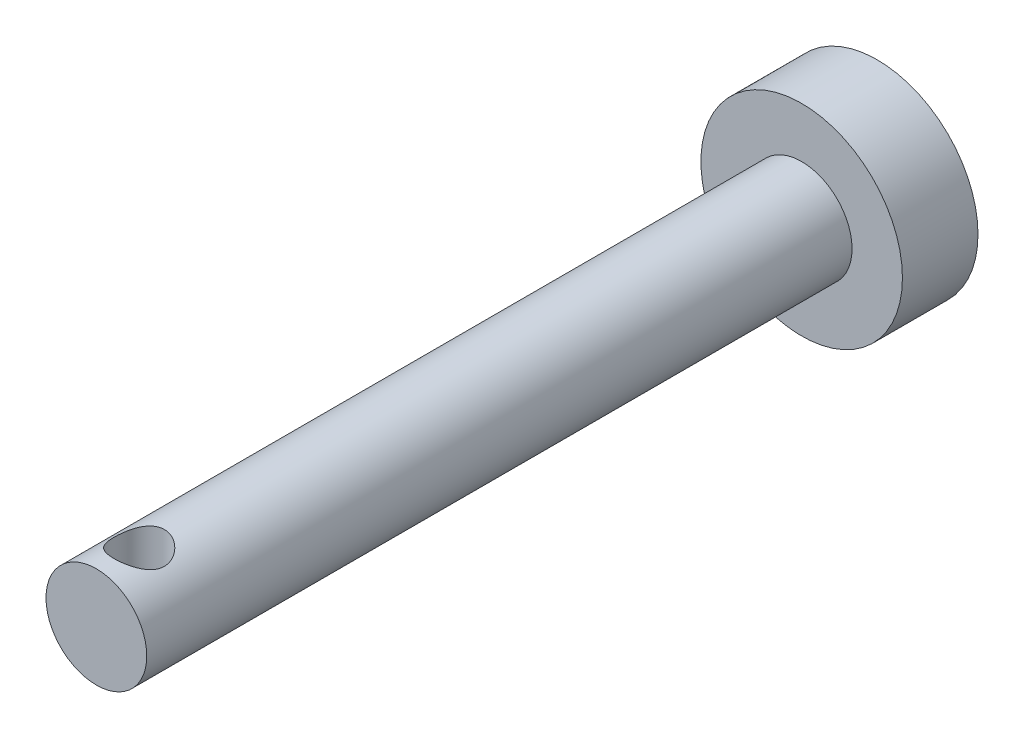
ISO-10303-21;
HEADER;
FILE_DESCRIPTION(('STEP AP214'),'2;1');
FILE_NAME('part.step','',(''),(''),'','','');
FILE_SCHEMA(('AUTOMOTIVE_DESIGN { 1 0 10303 214 1 1 1 1 }'));
ENDSEC;
DATA;
#1=APPLICATION_CONTEXT('core data for automotive mechanical design processes');
#2=APPLICATION_PROTOCOL_DEFINITION('international standard','automotive_design',2000,#1);
#3=PRODUCT_CONTEXT('',#1,'mechanical');
#4=PRODUCT('Part','Part','',(#3));
#5=PRODUCT_RELATED_PRODUCT_CATEGORY('part','',(#4));
#6=PRODUCT_DEFINITION_FORMATION('','',#4);
#7=PRODUCT_DEFINITION_CONTEXT('part definition',#1,'design');
#8=PRODUCT_DEFINITION('design','',#6,#7);
#9=PRODUCT_DEFINITION_SHAPE('','',#8);
#10=(LENGTH_UNIT() NAMED_UNIT(*) SI_UNIT(.MILLI.,.METRE.));
#11=(NAMED_UNIT(*) PLANE_ANGLE_UNIT() SI_UNIT($,.RADIAN.));
#12=(NAMED_UNIT(*) SI_UNIT($,.STERADIAN.) SOLID_ANGLE_UNIT());
#13=UNCERTAINTY_MEASURE_WITH_UNIT(LENGTH_MEASURE(1.E-05),#10,'distance_accuracy_value','');
#14=(GEOMETRIC_REPRESENTATION_CONTEXT(3) GLOBAL_UNCERTAINTY_ASSIGNED_CONTEXT((#13)) GLOBAL_UNIT_ASSIGNED_CONTEXT((#10,
#11,#12)) REPRESENTATION_CONTEXT('',''));
#15=CARTESIAN_POINT('',(0.,0.,0.));
#16=DIRECTION('',(0.,0.,1.));
#17=DIRECTION('',(1.,0.,0.));
#18=AXIS2_PLACEMENT_3D('',#15,#16,#17);
#19=CARTESIAN_POINT('',(0.,0.,-125.));
#20=DIRECTION('',(0.,0.,1.));
#21=DIRECTION('',(1.,0.,0.));
#22=AXIS2_PLACEMENT_3D('',#19,#20,#21);
#23=PLANE('',#22);
#24=CARTESIAN_POINT('',(0.,0.,-125.));
#25=DIRECTION('',(0.,0.,1.));
#26=DIRECTION('',(1.,0.,0.));
#27=AXIS2_PLACEMENT_3D('',#24,#25,#26);
#28=CIRCLE('',#27,4.);
#29=CARTESIAN_POINT('',(4.,0.,-125.));
#30=VERTEX_POINT('',#29);
#31=EDGE_CURVE('E10',#30,#30,#28,.T.);
#32=ORIENTED_EDGE('',*,*,#31,.F.);
#33=EDGE_LOOP('',(#32));
#34=FACE_BOUND('',#33,.T.);
#35=ADVANCED_FACE('F32',(#34),#23,.F.);
#36=CARTESIAN_POINT('',(0.,0.,125.));
#37=DIRECTION('',(0.,0.,1.));
#38=DIRECTION('',(1.,0.,0.));
#39=AXIS2_PLACEMENT_3D('',#36,#37,#38);
#40=CYLINDRICAL_SURFACE('',#39,4.);
#41=CARTESIAN_POINT('',(0.,0.,-122.));
#42=DIRECTION('',(0.,0.,1.));
#43=DIRECTION('',(1.,0.,0.));
#44=AXIS2_PLACEMENT_3D('',#41,#42,#43);
#45=CIRCLE('',#44,4.);
#46=CARTESIAN_POINT('',(4.,0.,-122.));
#47=VERTEX_POINT('',#46);
#48=EDGE_CURVE('E44',#47,#47,#45,.T.);
#49=ORIENTED_EDGE('',*,*,#48,.F.);
#50=EDGE_LOOP('',(#49));
#51=FACE_BOUND('',#50,.T.);
#52=ORIENTED_EDGE('',*,*,#31,.T.);
#53=EDGE_LOOP('',(#52));
#54=FACE_BOUND('',#53,.T.);
#55=ADVANCED_FACE('F79',(#51,#54),#40,.T.);
#56=CARTESIAN_POINT('',(0.,4.,-122.));
#57=DIRECTION('',(0.,0.,-1.));
#58=DIRECTION('',(-1.,0.,0.));
#59=AXIS2_PLACEMENT_3D('',#56,#57,#58);
#60=PLANE('',#59);
#61=CARTESIAN_POINT('',(0.,0.,-122.));
#62=DIRECTION('',(0.,0.,1.));
#63=DIRECTION('',(1.,0.,0.));
#64=AXIS2_PLACEMENT_3D('',#61,#62,#63);
#65=CIRCLE('',#64,2.00000000000003);
#66=CARTESIAN_POINT('',(2.00000000000003,0.,-122.));
#67=VERTEX_POINT('',#66);
#68=EDGE_CURVE('E49',#67,#67,#65,.T.);
#69=ORIENTED_EDGE('',*,*,#68,.F.);
#70=EDGE_LOOP('',(#69));
#71=FACE_BOUND('',#70,.T.);
#72=ORIENTED_EDGE('',*,*,#48,.T.);
#73=EDGE_LOOP('',(#72));
#74=FACE_BOUND('',#73,.T.);
#75=ADVANCED_FACE('F75',(#71,#74),#60,.F.);
#76=CARTESIAN_POINT('',(0.,0.,125.));
#77=DIRECTION('',(0.,0.,1.));
#78=DIRECTION('',(1.,0.,0.));
#79=AXIS2_PLACEMENT_3D('',#76,#77,#78);
#80=CYLINDRICAL_SURFACE('',#79,2.00000000000002);
#81=CARTESIAN_POINT('',(0.,-2.00000000000002,-94.7));
#82=CARTESIAN_POINT('',(0.0525719629529861,-1.99999713404152,-94.7000033023195));
#83=CARTESIAN_POINT('',(0.105206599698032,-1.99790491019519,-94.7041700731217));
#84=CARTESIAN_POINT('',(0.208920235268424,-1.98974156037398,-94.7206528803409));
#85=CARTESIAN_POINT('',(0.259996086713503,-1.98366287828985,-94.7329843929976));
#86=CARTESIAN_POINT('',(0.358933544880574,-1.96816279403313,-94.7651938086168));
#87=CARTESIAN_POINT('',(0.406806802939178,-1.95875439177522,-94.785042384248));
#88=CARTESIAN_POINT('',(0.498472616806563,-1.9374577651578,-94.8315706213649));
#89=CARTESIAN_POINT('',(0.542265493990048,-1.92556973633532,-94.8582497442489));
#90=CARTESIAN_POINT('',(0.62750781776192,-1.89956258258059,-94.9195172494853));
#91=CARTESIAN_POINT('',(0.668655211122115,-1.88535199127537,-94.9544864792396));
#92=CARTESIAN_POINT('',(0.744779444866981,-1.85659970246746,-95.030521479247));
#93=CARTESIAN_POINT('',(0.779751583106767,-1.84205776209037,-95.0715918517724));
#94=CARTESIAN_POINT('',(0.845252000450278,-1.81298951197349,-95.1624833495234));
#95=CARTESIAN_POINT('',(0.875225335551638,-1.79855186970133,-95.2127360983459));
#96=CARTESIAN_POINT('',(0.926168226890698,-1.77285978772322,-95.3183673359862));
#97=CARTESIAN_POINT('',(0.947144214966336,-1.76160307606991,-95.3737421287227));
#98=CARTESIAN_POINT('',(0.978132442188591,-1.7445786703781,-95.4846651054219));
#99=CARTESIAN_POINT('',(0.988725857080443,-1.73852271583715,-95.5400044520674));
#100=CARTESIAN_POINT('',(1.00042699330885,-1.73181889948529,-95.6519788377795));
#101=CARTESIAN_POINT('',(1.00154408837308,-1.7311656934329,-95.7086125408712));
#102=CARTESIAN_POINT('',(0.994687287172293,-1.7351093025725,-95.8142860243154));
#103=CARTESIAN_POINT('',(0.987784559536819,-1.73908763662015,-95.863424031223));
#104=CARTESIAN_POINT('',(0.966939849056931,-1.75076228733852,-95.959721909373));
#105=CARTESIAN_POINT('',(0.952995623897653,-1.75845978831778,-96.0068811453053));
#106=CARTESIAN_POINT('',(0.918209780386007,-1.77687476412743,-96.0992291325657));
#107=CARTESIAN_POINT('',(0.897215067115996,-1.78765840664,-96.1443463987858));
#108=CARTESIAN_POINT('',(0.849041687668001,-1.81103404281405,-96.23063429259));
#109=CARTESIAN_POINT('',(0.821860243812466,-1.82362684780192,-96.2718031356001));
#110=CARTESIAN_POINT('',(0.758066054912789,-1.85113157903287,-96.3545212527432));
#111=CARTESIAN_POINT('',(0.720694458369284,-1.86613510236748,-96.3954568735762));
#112=CARTESIAN_POINT('',(0.639555578741373,-1.89547623300409,-96.4707354185909));
#113=CARTESIAN_POINT('',(0.595785256574281,-1.90981351958803,-96.5050751920339));
#114=CARTESIAN_POINT('',(0.500516505831843,-1.93701987282966,-96.5676856610297));
#115=CARTESIAN_POINT('',(0.448753591599406,-1.94978984162009,-96.5956004724457));
#116=CARTESIAN_POINT('',(0.340466215488797,-1.97157881121244,-96.642097029043));
#117=CARTESIAN_POINT('',(0.283945576265277,-1.98060078943554,-96.6606861850152));
#118=CARTESIAN_POINT('',(0.172766491660702,-1.99324333741438,-96.6864754037167));
#119=CARTESIAN_POINT('',(0.118341530548324,-1.99724938301313,-96.6944912357468));
#120=CARTESIAN_POINT('',(0.00877959994935263,-2.00073013459103,-96.7014647311345));
#121=CARTESIAN_POINT('',(-0.0463570198699035,-2.00020698721314,-96.7004266856395));
#122=CARTESIAN_POINT('',(-0.151232971985996,-1.99491192253442,-96.6897933115812));
#123=CARTESIAN_POINT('',(-0.201059408049955,-1.99047245688191,-96.68086746727));
#124=CARTESIAN_POINT('',(-0.298406892301917,-1.9782217131482,-96.6557619281049));
#125=CARTESIAN_POINT('',(-0.345927685690998,-1.97041006334334,-96.6395814335466));
#126=CARTESIAN_POINT('',(-0.438888608449671,-1.95184251413671,-96.6000015335668));
#127=CARTESIAN_POINT('',(-0.484230397006162,-1.94100881769941,-96.5764089498832));
#128=CARTESIAN_POINT('',(-0.570461361698928,-1.9174397431711,-96.5228924643539));
#129=CARTESIAN_POINT('',(-0.611348629775286,-1.90470355565787,-96.4929658654066));
#130=CARTESIAN_POINT('',(-0.691767689290655,-1.87708221337466,-96.4242395746671));
#131=CARTESIAN_POINT('',(-0.730772077824641,-1.86210884848443,-96.3848571315464));
#132=CARTESIAN_POINT('',(-0.801856321113242,-1.83262391603876,-96.3000748487307));
#133=CARTESIAN_POINT('',(-0.833931385690844,-1.81811267381528,-96.2546708811836));
#134=CARTESIAN_POINT('',(-0.891707914497697,-1.7905119222607,-96.1563563457997));
#135=CARTESIAN_POINT('',(-0.917025495878638,-1.77752529663474,-96.1031887337914));
#136=CARTESIAN_POINT('',(-0.958082826013803,-1.75574072368128,-95.9924899323075));
#137=CARTESIAN_POINT('',(-0.97383491588757,-1.7469373824062,-95.9349644734988));
#138=CARTESIAN_POINT('',(-0.993861687449679,-1.73561501008669,-95.8230897771385));
#139=CARTESIAN_POINT('',(-0.999092996400865,-1.73257383460493,-95.768965746571));
#140=CARTESIAN_POINT('',(-1.00068915438079,-1.73165354646177,-95.6605529328293));
#141=CARTESIAN_POINT('',(-0.9970578466244,-1.73377219627554,-95.6062642312606));
#142=CARTESIAN_POINT('',(-0.981926125592264,-1.74237862050026,-95.504516498468));
#143=CARTESIAN_POINT('',(-0.9712083143428,-1.74843094482395,-95.4568995298556));
#144=CARTESIAN_POINT('',(-0.943175358224643,-1.76371016187919,-95.3641918805753));
#145=CARTESIAN_POINT('',(-0.925858091159808,-1.77293807569677,-95.319102017908));
#146=CARTESIAN_POINT('',(-0.88381574530068,-1.7942853036453,-95.2293751490134));
#147=CARTESIAN_POINT('',(-0.858671137816454,-1.80655722396193,-95.1849720981703));
#148=CARTESIAN_POINT('',(-0.802150971636628,-1.83235331634592,-95.1007254638194));
#149=CARTESIAN_POINT('',(-0.77077217123864,-1.84587813794524,-95.0608842694815));
#150=CARTESIAN_POINT('',(-0.698203326664633,-1.87462323159315,-94.9818580176424));
#151=CARTESIAN_POINT('',(-0.656284423010165,-1.8898498331147,-94.9433408976381));
#152=CARTESIAN_POINT('',(-0.566154806220276,-1.91877752255089,-94.8737370165764));
#153=CARTESIAN_POINT('',(-0.517940723256782,-1.93247778608042,-94.8426542605737));
#154=CARTESIAN_POINT('',(-0.415931596819944,-1.95698009585105,-94.7887636372378));
#155=CARTESIAN_POINT('',(-0.362099503934612,-1.96776096562911,-94.7660158305886));
#156=CARTESIAN_POINT('',(-0.250742101294191,-1.98501341363467,-94.730191832081));
#157=CARTESIAN_POINT('',(-0.193227799623167,-1.99149723372934,-94.7170881531704));
#158=CARTESIAN_POINT('',(-0.112601946483385,-1.99695461909665,-94.7061025889241));
#159=CARTESIAN_POINT('',(-0.0901618794395,-1.99809365339203,-94.7038173591364));
#160=CARTESIAN_POINT('',(-0.0451517318071583,-1.99961696977866,-94.7007653344832));
#161=CARTESIAN_POINT('',(-0.0225816476473817,-2.00000123103765,-94.6999985815288));
#162=CARTESIAN_POINT('',(0.,-2.00000000000002,-94.7));
#163=B_SPLINE_CURVE_WITH_KNOTS('',3,(#81,#82,#83,#84,#85,#86,#87,#88,#89,#90,#91,#92,#93,#94,
#95,#96,#97,#98,#99,#100,#101,#102,#103,#104,#105,#106,#107,#108,#109,#110,#111,#112,#113,#114,
#115,#116,#117,#118,#119,#120,#121,#122,#123,#124,#125,#126,#127,#128,#129,#130,#131,#132,#133,
#134,#135,#136,#137,#138,#139,#140,#141,#142,#143,#144,#145,#146,#147,#148,#149,#150,#151,#152,
#153,#154,#155,#156,#157,#158,#159,#160,#161,#162),.UNSPECIFIED.,.T.,.F.,(4,2,2,2,2,2,2,2,2,2,2,
2,2,2,2,2,2,2,2,2,2,2,2,2,2,2,2,2,2,2,2,2,2,2,2,2,2,2,2,2,4),(0.,0.157624257420292,
0.315548149709195,0.472862155492292,0.630163760581568,0.796981758718097,0.96392623765404,
1.14381726430753,1.32357947898281,1.4925801214023,1.66141357329022,1.81005712409322,
1.95874803925679,2.11090240168488,2.26312521260222,2.43464941333879,2.60625534598687,
2.78583022214441,2.9652621691228,3.12983290471346,3.29432564511476,3.44606906506122,
3.59782921630932,3.753928560279,3.91009450748339,4.08159610644419,4.25321588615433,
4.43314682159675,4.61284511940778,4.77529307498373,4.93767059860005,5.08457930244184,
5.23153528783679,5.38836456775616,5.54527561138959,5.721252427525,5.89732383376574,
6.07464013662926,6.2514490862493,6.31915280137698,6.38685838514847),.UNSPECIFIED.);
#164=CARTESIAN_POINT('',(0.,-2.00000000000002,-94.7));
#165=VERTEX_POINT('',#164);
#166=EDGE_CURVE('E35',#165,#165,#163,.T.);
#167=ORIENTED_EDGE('',*,*,#166,.T.);
#168=EDGE_LOOP('',(#167));
#169=FACE_BOUND('',#168,.T.);
#170=CARTESIAN_POINT('',(0.,2.00000000000002,-94.7));
#171=CARTESIAN_POINT('',(-0.0525719629529861,1.99999713404152,-94.7000033023195));
#172=CARTESIAN_POINT('',(-0.105206599698032,1.99790491019519,-94.7041700731217));
#173=CARTESIAN_POINT('',(-0.208920235268424,1.98974156037398,-94.7206528803409));
#174=CARTESIAN_POINT('',(-0.259996086713503,1.98366287828985,-94.7329843929976));
#175=CARTESIAN_POINT('',(-0.358933544880574,1.96816279403313,-94.7651938086168));
#176=CARTESIAN_POINT('',(-0.406806802939178,1.95875439177522,-94.785042384248));
#177=CARTESIAN_POINT('',(-0.498472616806563,1.9374577651578,-94.8315706213649));
#178=CARTESIAN_POINT('',(-0.542265493990048,1.92556973633532,-94.8582497442489));
#179=CARTESIAN_POINT('',(-0.62750781776192,1.89956258258059,-94.9195172494853));
#180=CARTESIAN_POINT('',(-0.668655211122115,1.88535199127537,-94.9544864792396));
#181=CARTESIAN_POINT('',(-0.744779444866981,1.85659970246746,-95.030521479247));
#182=CARTESIAN_POINT('',(-0.779751583106767,1.84205776209037,-95.0715918517724));
#183=CARTESIAN_POINT('',(-0.845252000450278,1.81298951197349,-95.1624833495234));
#184=CARTESIAN_POINT('',(-0.875225335551638,1.79855186970133,-95.2127360983459));
#185=CARTESIAN_POINT('',(-0.926168226890698,1.77285978772322,-95.3183673359862));
#186=CARTESIAN_POINT('',(-0.947144214966336,1.76160307606991,-95.3737421287227));
#187=CARTESIAN_POINT('',(-0.978132442188591,1.7445786703781,-95.4846651054219));
#188=CARTESIAN_POINT('',(-0.988725857080443,1.73852271583715,-95.5400044520674));
#189=CARTESIAN_POINT('',(-1.00042699330885,1.73181889948529,-95.6519788377795));
#190=CARTESIAN_POINT('',(-1.00154408837308,1.7311656934329,-95.7086125408712));
#191=CARTESIAN_POINT('',(-0.994687287172293,1.7351093025725,-95.8142860243154));
#192=CARTESIAN_POINT('',(-0.987784559536819,1.73908763662015,-95.863424031223));
#193=CARTESIAN_POINT('',(-0.966939849056931,1.75076228733852,-95.959721909373));
#194=CARTESIAN_POINT('',(-0.952995623897653,1.75845978831778,-96.0068811453053));
#195=CARTESIAN_POINT('',(-0.918209780386007,1.77687476412743,-96.0992291325657));
#196=CARTESIAN_POINT('',(-0.897215067115996,1.78765840664,-96.1443463987858));
#197=CARTESIAN_POINT('',(-0.849041687668001,1.81103404281405,-96.23063429259));
#198=CARTESIAN_POINT('',(-0.821860243812466,1.82362684780192,-96.2718031356001));
#199=CARTESIAN_POINT('',(-0.758066054912789,1.85113157903287,-96.3545212527432));
#200=CARTESIAN_POINT('',(-0.720694458369284,1.86613510236748,-96.3954568735762));
#201=CARTESIAN_POINT('',(-0.639555578741373,1.89547623300409,-96.4707354185909));
#202=CARTESIAN_POINT('',(-0.595785256574281,1.90981351958803,-96.5050751920339));
#203=CARTESIAN_POINT('',(-0.500516505831843,1.93701987282966,-96.5676856610297));
#204=CARTESIAN_POINT('',(-0.448753591599406,1.94978984162009,-96.5956004724457));
#205=CARTESIAN_POINT('',(-0.340466215488797,1.97157881121244,-96.642097029043));
#206=CARTESIAN_POINT('',(-0.283945576265277,1.98060078943554,-96.6606861850152));
#207=CARTESIAN_POINT('',(-0.172766491660702,1.99324333741438,-96.6864754037167));
#208=CARTESIAN_POINT('',(-0.118341530548324,1.99724938301313,-96.6944912357468));
#209=CARTESIAN_POINT('',(-0.00877959994935263,2.00073013459103,-96.7014647311345));
#210=CARTESIAN_POINT('',(0.0463570198699035,2.00020698721314,-96.7004266856395));
#211=CARTESIAN_POINT('',(0.151232971985996,1.99491192253442,-96.6897933115812));
#212=CARTESIAN_POINT('',(0.201059408049955,1.99047245688191,-96.68086746727));
#213=CARTESIAN_POINT('',(0.298406892301917,1.9782217131482,-96.6557619281049));
#214=CARTESIAN_POINT('',(0.345927685690998,1.97041006334334,-96.6395814335466));
#215=CARTESIAN_POINT('',(0.438888608449671,1.95184251413671,-96.6000015335668));
#216=CARTESIAN_POINT('',(0.484230397006162,1.94100881769941,-96.5764089498832));
#217=CARTESIAN_POINT('',(0.570461361698928,1.9174397431711,-96.5228924643539));
#218=CARTESIAN_POINT('',(0.611348629775286,1.90470355565787,-96.4929658654066));
#219=CARTESIAN_POINT('',(0.691767689290655,1.87708221337466,-96.4242395746671));
#220=CARTESIAN_POINT('',(0.730772077824641,1.86210884848443,-96.3848571315464));
#221=CARTESIAN_POINT('',(0.801856321113242,1.83262391603876,-96.3000748487307));
#222=CARTESIAN_POINT('',(0.833931385690844,1.81811267381528,-96.2546708811836));
#223=CARTESIAN_POINT('',(0.891707914497697,1.7905119222607,-96.1563563457997));
#224=CARTESIAN_POINT('',(0.917025495878638,1.77752529663474,-96.1031887337914));
#225=CARTESIAN_POINT('',(0.958082826013803,1.75574072368128,-95.9924899323075));
#226=CARTESIAN_POINT('',(0.97383491588757,1.7469373824062,-95.9349644734988));
#227=CARTESIAN_POINT('',(0.993861687449679,1.73561501008669,-95.8230897771385));
#228=CARTESIAN_POINT('',(0.999092996400865,1.73257383460493,-95.768965746571));
#229=CARTESIAN_POINT('',(1.00068915438079,1.73165354646177,-95.6605529328293));
#230=CARTESIAN_POINT('',(0.9970578466244,1.73377219627554,-95.6062642312606));
#231=CARTESIAN_POINT('',(0.981926125592264,1.74237862050026,-95.504516498468));
#232=CARTESIAN_POINT('',(0.9712083143428,1.74843094482395,-95.4568995298556));
#233=CARTESIAN_POINT('',(0.943175358224643,1.76371016187919,-95.3641918805753));
#234=CARTESIAN_POINT('',(0.925858091159808,1.77293807569677,-95.319102017908));
#235=CARTESIAN_POINT('',(0.88381574530068,1.7942853036453,-95.2293751490134));
#236=CARTESIAN_POINT('',(0.858671137816454,1.80655722396193,-95.1849720981703));
#237=CARTESIAN_POINT('',(0.802150971636628,1.83235331634592,-95.1007254638194));
#238=CARTESIAN_POINT('',(0.77077217123864,1.84587813794524,-95.0608842694815));
#239=CARTESIAN_POINT('',(0.698203326664633,1.87462323159315,-94.9818580176424));
#240=CARTESIAN_POINT('',(0.656284423010165,1.8898498331147,-94.9433408976381));
#241=CARTESIAN_POINT('',(0.566154806220276,1.91877752255089,-94.8737370165764));
#242=CARTESIAN_POINT('',(0.517940723256782,1.93247778608042,-94.8426542605737));
#243=CARTESIAN_POINT('',(0.415931596819944,1.95698009585105,-94.7887636372378));
#244=CARTESIAN_POINT('',(0.362099503934612,1.96776096562911,-94.7660158305886));
#245=CARTESIAN_POINT('',(0.250742101294191,1.98501341363467,-94.730191832081));
#246=CARTESIAN_POINT('',(0.193227799623167,1.99149723372934,-94.7170881531704));
#247=CARTESIAN_POINT('',(0.112601946483385,1.99695461909665,-94.7061025889241));
#248=CARTESIAN_POINT('',(0.0901618794395,1.99809365339203,-94.7038173591364));
#249=CARTESIAN_POINT('',(0.0451517318071583,1.99961696977866,-94.7007653344832));
#250=CARTESIAN_POINT('',(0.0225816476473817,2.00000123103765,-94.6999985815288));
#251=CARTESIAN_POINT('',(0.,2.00000000000002,-94.7));
#252=B_SPLINE_CURVE_WITH_KNOTS('',3,(#170,#171,#172,#173,#174,#175,#176,#177,#178,#179,#180,
#181,#182,#183,#184,#185,#186,#187,#188,#189,#190,#191,#192,#193,#194,#195,#196,#197,#198,#199,
#200,#201,#202,#203,#204,#205,#206,#207,#208,#209,#210,#211,#212,#213,#214,#215,#216,#217,#218,
#219,#220,#221,#222,#223,#224,#225,#226,#227,#228,#229,#230,#231,#232,#233,#234,#235,#236,#237,
#238,#239,#240,#241,#242,#243,#244,#245,#246,#247,#248,#249,#250,#251),.UNSPECIFIED.,.T.,.F.,(4,
2,2,2,2,2,2,2,2,2,2,2,2,2,2,2,2,2,2,2,2,2,2,2,2,2,2,2,2,2,2,2,2,2,2,2,2,2,2,2,4),(0.,
0.157624257420292,0.315548149709195,0.472862155492292,0.630163760581568,0.796981758718097,
0.96392623765404,1.14381726430753,1.32357947898281,1.4925801214023,1.66141357329022,
1.81005712409322,1.95874803925679,2.11090240168488,2.26312521260222,2.43464941333879,
2.60625534598687,2.78583022214441,2.9652621691228,3.12983290471346,3.29432564511476,
3.44606906506122,3.59782921630932,3.753928560279,3.91009450748339,4.08159610644419,
4.25321588615433,4.43314682159675,4.61284511940778,4.77529307498373,4.93767059860005,
5.08457930244184,5.23153528783679,5.38836456775616,5.54527561138959,5.721252427525,
5.89732383376574,6.07464013662926,6.2514490862493,6.31915280137698,6.38685838514847),.UNSPECIFIED.);
#253=CARTESIAN_POINT('',(0.,2.00000000000002,-94.7));
#254=VERTEX_POINT('',#253);
#255=EDGE_CURVE('E55',#254,#254,#252,.T.);
#256=ORIENTED_EDGE('',*,*,#255,.T.);
#257=EDGE_LOOP('',(#256));
#258=FACE_BOUND('',#257,.T.);
#259=CARTESIAN_POINT('',(0.,0.,-94.));
#260=DIRECTION('',(0.,0.,-1.));
#261=DIRECTION('',(-1.,0.,0.));
#262=AXIS2_PLACEMENT_3D('',#259,#260,#261);
#263=CIRCLE('',#262,2.00000000000002);
#264=CARTESIAN_POINT('',(-2.00000000000002,0.,-94.));
#265=VERTEX_POINT('',#264);
#266=EDGE_CURVE('E53',#265,#265,#263,.T.);
#267=ORIENTED_EDGE('',*,*,#266,.T.);
#268=EDGE_LOOP('',(#267));
#269=FACE_BOUND('',#268,.T.);
#270=ORIENTED_EDGE('',*,*,#68,.T.);
#271=EDGE_LOOP('',(#270));
#272=FACE_BOUND('',#271,.T.);
#273=ADVANCED_FACE('F60',(#169,#258,#269,#272),#80,.T.);
#274=CARTESIAN_POINT('',(-4.,4.06732485631839,-94.));
#275=DIRECTION('',(0.,0.,-1.));
#276=DIRECTION('',(-1.,0.,0.));
#277=AXIS2_PLACEMENT_3D('',#274,#275,#276);
#278=PLANE('',#277);
#279=ORIENTED_EDGE('',*,*,#266,.F.);
#280=EDGE_LOOP('',(#279));
#281=FACE_BOUND('',#280,.T.);
#282=ADVANCED_FACE('F67',(#281),#278,.F.);
#283=CARTESIAN_POINT('',(0.,-4.,-95.7));
#284=DIRECTION('',(0.,1.,0.));
#285=DIRECTION('',(0.,0.,1.));
#286=AXIS2_PLACEMENT_3D('',#283,#284,#285);
#287=CYLINDRICAL_SURFACE('',#286,1.);
#288=ORIENTED_EDGE('',*,*,#255,.F.);
#289=EDGE_LOOP('',(#288));
#290=FACE_BOUND('',#289,.T.);
#291=ORIENTED_EDGE('',*,*,#166,.F.);
#292=EDGE_LOOP('',(#291));
#293=FACE_BOUND('',#292,.T.);
#294=ADVANCED_FACE('F64',(#290,#293),#287,.F.);
#295=CLOSED_SHELL('',(#35,#55,#75,#273,#282,#294));
#296=MANIFOLD_SOLID_BREP('B2',#295);
#297=ADVANCED_BREP_SHAPE_REPRESENTATION('',(#18,#296),#14);
#298=SHAPE_DEFINITION_REPRESENTATION(#9,#297);
ENDSEC;
END-ISO-10303-21;
